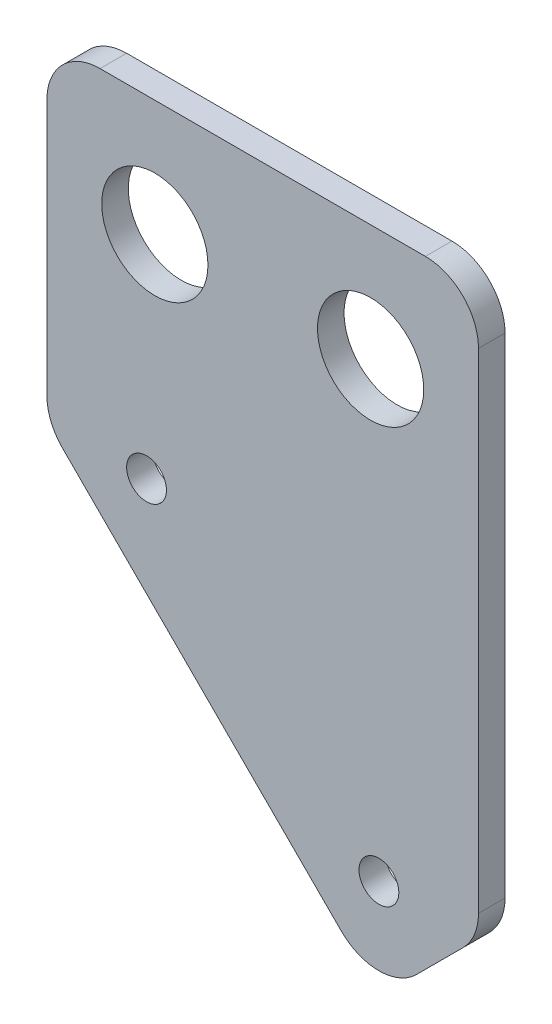
ISO-10303-21;
HEADER;
FILE_DESCRIPTION(('STEP AP214'),'2;1');
FILE_NAME('part.step','',(''),(''),'','','');
FILE_SCHEMA(('AUTOMOTIVE_DESIGN { 1 0 10303 214 1 1 1 1 }'));
ENDSEC;
DATA;
#1=APPLICATION_CONTEXT('core data for automotive mechanical design processes');
#2=APPLICATION_PROTOCOL_DEFINITION('international standard','automotive_design',2000,#1);
#3=PRODUCT_CONTEXT('',#1,'mechanical');
#4=PRODUCT('Part','Part','',(#3));
#5=PRODUCT_RELATED_PRODUCT_CATEGORY('part','',(#4));
#6=PRODUCT_DEFINITION_FORMATION('','',#4);
#7=PRODUCT_DEFINITION_CONTEXT('part definition',#1,'design');
#8=PRODUCT_DEFINITION('design','',#6,#7);
#9=PRODUCT_DEFINITION_SHAPE('','',#8);
#10=(LENGTH_UNIT() NAMED_UNIT(*) SI_UNIT(.MILLI.,.METRE.));
#11=(NAMED_UNIT(*) PLANE_ANGLE_UNIT() SI_UNIT($,.RADIAN.));
#12=(NAMED_UNIT(*) SI_UNIT($,.STERADIAN.) SOLID_ANGLE_UNIT());
#13=UNCERTAINTY_MEASURE_WITH_UNIT(LENGTH_MEASURE(1.E-05),#10,'distance_accuracy_value','');
#14=(GEOMETRIC_REPRESENTATION_CONTEXT(3) GLOBAL_UNCERTAINTY_ASSIGNED_CONTEXT((#13)) GLOBAL_UNIT_ASSIGNED_CONTEXT((#10,
#11,#12)) REPRESENTATION_CONTEXT('',''));
#15=CARTESIAN_POINT('',(0.,0.,0.));
#16=DIRECTION('',(0.,0.,1.));
#17=DIRECTION('',(1.,0.,0.));
#18=AXIS2_PLACEMENT_3D('',#15,#16,#17);
#19=CARTESIAN_POINT('',(-3.5,1.65685424949238,2.));
#20=DIRECTION('',(0.,0.,1.));
#21=DIRECTION('',(1.,0.,0.));
#22=AXIS2_PLACEMENT_3D('',#19,#20,#21);
#23=PLANE('',#22);
#24=CARTESIAN_POINT('',(0.624999999999999,16.25,2.));
#25=DIRECTION('',(0.,0.,1.));
#26=DIRECTION('',(1.,0.,0.));
#27=AXIS2_PLACEMENT_3D('',#24,#25,#26);
#28=CIRCLE('',#27,4.);
#29=CARTESIAN_POINT('',(4.625,16.25,2.));
#30=VERTEX_POINT('',#29);
#31=EDGE_CURVE('E218',#30,#30,#28,.T.);
#32=ORIENTED_EDGE('',*,*,#31,.F.);
#33=EDGE_LOOP('',(#32));
#34=FACE_BOUND('',#33,.T.);
#35=CARTESIAN_POINT('',(0.,0.,2.));
#36=DIRECTION('',(0.,0.,1.));
#37=DIRECTION('',(1.,0.,0.));
#38=AXIS2_PLACEMENT_3D('',#35,#36,#37);
#39=CIRCLE('',#38,1.5);
#40=CARTESIAN_POINT('',(1.5,0.,2.));
#41=VERTEX_POINT('',#40);
#42=EDGE_CURVE('E146',#41,#41,#39,.T.);
#43=ORIENTED_EDGE('',*,*,#42,.F.);
#44=EDGE_LOOP('',(#43));
#45=FACE_BOUND('',#44,.T.);
#46=CARTESIAN_POINT('',(-3.5,1.65685424949238,2.));
#47=DIRECTION('',(0.,0.,1.));
#48=DIRECTION('',(1.,0.,0.));
#49=AXIS2_PLACEMENT_3D('',#46,#47,#48);
#50=CIRCLE('',#49,4.);
#51=CARTESIAN_POINT('',(-7.5,1.6568542494924,2.));
#52=VERTEX_POINT('',#51);
#53=CARTESIAN_POINT('',(-6.32842712474618,-1.17157287525382,2.));
#54=VERTEX_POINT('',#53);
#55=EDGE_CURVE('E161',#52,#54,#50,.T.);
#56=ORIENTED_EDGE('',*,*,#55,.T.);
#57=DIRECTION('',(0.707106781186547,-0.707106781186547,0.));
#58=VECTOR('',#57,1.);
#59=CARTESIAN_POINT('',(14.6715728752538,-22.1715728752538,2.));
#60=LINE('',#59,#58);
#61=CARTESIAN_POINT('',(14.6715728752538,-22.1715728752538,2.));
#62=VERTEX_POINT('',#61);
#63=EDGE_CURVE('E99',#54,#62,#60,.T.);
#64=ORIENTED_EDGE('',*,*,#63,.T.);
#65=CARTESIAN_POINT('',(17.5,-19.3431457505076,2.));
#66=DIRECTION('',(0.,0.,1.));
#67=DIRECTION('',(-1.,0.,0.));
#68=AXIS2_PLACEMENT_3D('',#65,#66,#67);
#69=CIRCLE('',#68,4.);
#70=CARTESIAN_POINT('',(20.3284271247462,-22.1715728752538,2.));
#71=VERTEX_POINT('',#70);
#72=EDGE_CURVE('E182',#62,#71,#69,.T.);
#73=ORIENTED_EDGE('',*,*,#72,.T.);
#74=DIRECTION('',(0.707106781186547,0.707106781186547,0.));
#75=VECTOR('',#74,1.);
#76=CARTESIAN_POINT('',(23.8284271247462,-18.6715728752538,2.));
#77=LINE('',#76,#75);
#78=CARTESIAN_POINT('',(23.8284271247462,-18.6715728752538,2.));
#79=VERTEX_POINT('',#78);
#80=EDGE_CURVE('E201',#71,#79,#77,.T.);
#81=ORIENTED_EDGE('',*,*,#80,.T.);
#82=CARTESIAN_POINT('',(21.,-15.8431457505076,2.));
#83=DIRECTION('',(0.,0.,1.));
#84=DIRECTION('',(1.,0.,0.));
#85=AXIS2_PLACEMENT_3D('',#82,#83,#84);
#86=CIRCLE('',#85,4.);
#87=CARTESIAN_POINT('',(25.,-15.8431457505076,2.));
#88=VERTEX_POINT('',#87);
#89=EDGE_CURVE('E198',#79,#88,#86,.T.);
#90=ORIENTED_EDGE('',*,*,#89,.T.);
#91=DIRECTION('',(0.,1.,0.));
#92=VECTOR('',#91,1.);
#93=CARTESIAN_POINT('',(25.,21.,2.));
#94=LINE('',#93,#92);
#95=CARTESIAN_POINT('',(25.,21.,2.));
#96=VERTEX_POINT('',#95);
#97=EDGE_CURVE('E200',#88,#96,#94,.T.);
#98=ORIENTED_EDGE('',*,*,#97,.T.);
#99=CARTESIAN_POINT('',(21.,21.,2.));
#100=DIRECTION('',(0.,0.,1.));
#101=DIRECTION('',(-1.,0.,0.));
#102=AXIS2_PLACEMENT_3D('',#99,#100,#101);
#103=CIRCLE('',#102,4.);
#104=CARTESIAN_POINT('',(21.,25.,2.));
#105=VERTEX_POINT('',#104);
#106=EDGE_CURVE('E124',#96,#105,#103,.T.);
#107=ORIENTED_EDGE('',*,*,#106,.T.);
#108=DIRECTION('',(-1.,0.,0.));
#109=VECTOR('',#108,1.);
#110=CARTESIAN_POINT('',(-3.49999999999997,25.,2.));
#111=LINE('',#110,#109);
#112=CARTESIAN_POINT('',(-3.49999999999997,25.,2.));
#113=VERTEX_POINT('',#112);
#114=EDGE_CURVE('E118',#105,#113,#111,.T.);
#115=ORIENTED_EDGE('',*,*,#114,.T.);
#116=CARTESIAN_POINT('',(-3.5,21.,2.));
#117=DIRECTION('',(0.,0.,1.));
#118=DIRECTION('',(-1.,0.,0.));
#119=AXIS2_PLACEMENT_3D('',#116,#117,#118);
#120=CIRCLE('',#119,4.);
#121=CARTESIAN_POINT('',(-7.5,21.,2.));
#122=VERTEX_POINT('',#121);
#123=EDGE_CURVE('E122',#113,#122,#120,.T.);
#124=ORIENTED_EDGE('',*,*,#123,.T.);
#125=DIRECTION('',(0.,-1.,0.));
#126=VECTOR('',#125,1.);
#127=CARTESIAN_POINT('',(-7.5,1.6568542494924,2.));
#128=LINE('',#127,#126);
#129=EDGE_CURVE('E50',#122,#52,#128,.T.);
#130=ORIENTED_EDGE('',*,*,#129,.T.);
#131=EDGE_LOOP('',(#56,#64,#73,#81,#90,#98,#107,#115,#124,#130));
#132=FACE_BOUND('',#131,.T.);
#133=CARTESIAN_POINT('',(17.5,-17.5,2.));
#134=DIRECTION('',(0.,0.,1.));
#135=DIRECTION('',(1.,0.,0.));
#136=AXIS2_PLACEMENT_3D('',#133,#134,#135);
#137=CIRCLE('',#136,1.5);
#138=CARTESIAN_POINT('',(19.,-17.5,2.));
#139=VERTEX_POINT('',#138);
#140=EDGE_CURVE('E212',#139,#139,#137,.T.);
#141=ORIENTED_EDGE('',*,*,#140,.F.);
#142=EDGE_LOOP('',(#141));
#143=FACE_BOUND('',#142,.T.);
#144=CARTESIAN_POINT('',(16.875,16.25,2.));
#145=DIRECTION('',(0.,0.,1.));
#146=DIRECTION('',(1.,0.,0.));
#147=AXIS2_PLACEMENT_3D('',#144,#145,#146);
#148=CIRCLE('',#147,4.);
#149=CARTESIAN_POINT('',(20.875,16.25,2.));
#150=VERTEX_POINT('',#149);
#151=EDGE_CURVE('E224',#150,#150,#148,.T.);
#152=ORIENTED_EDGE('',*,*,#151,.F.);
#153=EDGE_LOOP('',(#152));
#154=FACE_BOUND('',#153,.T.);
#155=ADVANCED_FACE('F33',(#34,#45,#132,#143,#154),#23,.T.);
#156=CARTESIAN_POINT('',(-3.5,1.65685424949238,0.));
#157=DIRECTION('',(0.,0.,1.));
#158=DIRECTION('',(1.,0.,0.));
#159=AXIS2_PLACEMENT_3D('',#156,#157,#158);
#160=PLANE('',#159);
#161=CARTESIAN_POINT('',(-3.5,1.65685424949238,0.));
#162=DIRECTION('',(0.,0.,1.));
#163=DIRECTION('',(1.,0.,0.));
#164=AXIS2_PLACEMENT_3D('',#161,#162,#163);
#165=CIRCLE('',#164,4.);
#166=CARTESIAN_POINT('',(-7.5,1.6568542494924,0.));
#167=VERTEX_POINT('',#166);
#168=CARTESIAN_POINT('',(-6.32842712474618,-1.17157287525382,0.));
#169=VERTEX_POINT('',#168);
#170=EDGE_CURVE('E142',#167,#169,#165,.T.);
#171=ORIENTED_EDGE('',*,*,#170,.F.);
#172=DIRECTION('',(0.,-1.,0.));
#173=VECTOR('',#172,1.);
#174=CARTESIAN_POINT('',(-7.5,1.6568542494924,0.));
#175=LINE('',#174,#173);
#176=CARTESIAN_POINT('',(-7.5,21.,0.));
#177=VERTEX_POINT('',#176);
#178=EDGE_CURVE('E91',#177,#167,#175,.T.);
#179=ORIENTED_EDGE('',*,*,#178,.F.);
#180=CARTESIAN_POINT('',(-3.5,21.,0.));
#181=DIRECTION('',(0.,0.,1.));
#182=DIRECTION('',(-1.,0.,0.));
#183=AXIS2_PLACEMENT_3D('',#180,#181,#182);
#184=CIRCLE('',#183,4.);
#185=CARTESIAN_POINT('',(-3.49999999999997,25.,0.));
#186=VERTEX_POINT('',#185);
#187=EDGE_CURVE('E85',#186,#177,#184,.T.);
#188=ORIENTED_EDGE('',*,*,#187,.F.);
#189=DIRECTION('',(-1.,0.,0.));
#190=VECTOR('',#189,1.);
#191=CARTESIAN_POINT('',(-3.49999999999997,25.,0.));
#192=LINE('',#191,#190);
#193=CARTESIAN_POINT('',(21.,25.,0.));
#194=VERTEX_POINT('',#193);
#195=EDGE_CURVE('E132',#194,#186,#192,.T.);
#196=ORIENTED_EDGE('',*,*,#195,.F.);
#197=CARTESIAN_POINT('',(21.,21.,0.));
#198=DIRECTION('',(0.,0.,1.));
#199=DIRECTION('',(-1.,0.,0.));
#200=AXIS2_PLACEMENT_3D('',#197,#198,#199);
#201=CIRCLE('',#200,4.);
#202=CARTESIAN_POINT('',(25.,21.,0.));
#203=VERTEX_POINT('',#202);
#204=EDGE_CURVE('E156',#203,#194,#201,.T.);
#205=ORIENTED_EDGE('',*,*,#204,.F.);
#206=DIRECTION('',(0.,1.,0.));
#207=VECTOR('',#206,1.);
#208=CARTESIAN_POINT('',(25.,21.,0.));
#209=LINE('',#208,#207);
#210=CARTESIAN_POINT('',(25.,-15.8431457505076,0.));
#211=VERTEX_POINT('',#210);
#212=EDGE_CURVE('E154',#211,#203,#209,.T.);
#213=ORIENTED_EDGE('',*,*,#212,.F.);
#214=CARTESIAN_POINT('',(21.,-15.8431457505076,0.));
#215=DIRECTION('',(0.,0.,1.));
#216=DIRECTION('',(1.,0.,0.));
#217=AXIS2_PLACEMENT_3D('',#214,#215,#216);
#218=CIRCLE('',#217,4.);
#219=CARTESIAN_POINT('',(23.8284271247462,-18.6715728752538,0.));
#220=VERTEX_POINT('',#219);
#221=EDGE_CURVE('E152',#220,#211,#218,.T.);
#222=ORIENTED_EDGE('',*,*,#221,.F.);
#223=DIRECTION('',(0.707106781186547,0.707106781186547,0.));
#224=VECTOR('',#223,1.);
#225=CARTESIAN_POINT('',(23.8284271247462,-18.6715728752538,0.));
#226=LINE('',#225,#224);
#227=CARTESIAN_POINT('',(20.3284271247462,-22.1715728752538,0.));
#228=VERTEX_POINT('',#227);
#229=EDGE_CURVE('E150',#228,#220,#226,.T.);
#230=ORIENTED_EDGE('',*,*,#229,.F.);
#231=CARTESIAN_POINT('',(17.5,-19.3431457505076,0.));
#232=DIRECTION('',(0.,0.,1.));
#233=DIRECTION('',(-1.,0.,0.));
#234=AXIS2_PLACEMENT_3D('',#231,#232,#233);
#235=CIRCLE('',#234,4.);
#236=CARTESIAN_POINT('',(14.6715728752538,-22.1715728752538,0.));
#237=VERTEX_POINT('',#236);
#238=EDGE_CURVE('E148',#237,#228,#235,.T.);
#239=ORIENTED_EDGE('',*,*,#238,.F.);
#240=DIRECTION('',(0.707106781186547,-0.707106781186547,0.));
#241=VECTOR('',#240,1.);
#242=CARTESIAN_POINT('',(14.6715728752538,-22.1715728752538,0.));
#243=LINE('',#242,#241);
#244=EDGE_CURVE('E145',#169,#237,#243,.T.);
#245=ORIENTED_EDGE('',*,*,#244,.F.);
#246=EDGE_LOOP('',(#171,#179,#188,#196,#205,#213,#222,#230,#239,#245));
#247=FACE_BOUND('',#246,.T.);
#248=CARTESIAN_POINT('',(0.,0.,0.));
#249=DIRECTION('',(0.,0.,1.));
#250=DIRECTION('',(1.,0.,0.));
#251=AXIS2_PLACEMENT_3D('',#248,#249,#250);
#252=CIRCLE('',#251,1.5);
#253=CARTESIAN_POINT('',(1.5,0.,0.));
#254=VERTEX_POINT('',#253);
#255=EDGE_CURVE('E209',#254,#254,#252,.T.);
#256=ORIENTED_EDGE('',*,*,#255,.T.);
#257=EDGE_LOOP('',(#256));
#258=FACE_BOUND('',#257,.T.);
#259=CARTESIAN_POINT('',(17.5,-17.5,0.));
#260=DIRECTION('',(0.,0.,1.));
#261=DIRECTION('',(1.,0.,0.));
#262=AXIS2_PLACEMENT_3D('',#259,#260,#261);
#263=CIRCLE('',#262,1.5);
#264=CARTESIAN_POINT('',(19.,-17.5,0.));
#265=VERTEX_POINT('',#264);
#266=EDGE_CURVE('E215',#265,#265,#263,.T.);
#267=ORIENTED_EDGE('',*,*,#266,.T.);
#268=EDGE_LOOP('',(#267));
#269=FACE_BOUND('',#268,.T.);
#270=CARTESIAN_POINT('',(0.624999999999999,16.25,0.));
#271=DIRECTION('',(0.,0.,1.));
#272=DIRECTION('',(1.,0.,0.));
#273=AXIS2_PLACEMENT_3D('',#270,#271,#272);
#274=CIRCLE('',#273,4.);
#275=CARTESIAN_POINT('',(4.625,16.25,0.));
#276=VERTEX_POINT('',#275);
#277=EDGE_CURVE('E221',#276,#276,#274,.T.);
#278=ORIENTED_EDGE('',*,*,#277,.T.);
#279=EDGE_LOOP('',(#278));
#280=FACE_BOUND('',#279,.T.);
#281=CARTESIAN_POINT('',(16.875,16.25,0.));
#282=DIRECTION('',(0.,0.,1.));
#283=DIRECTION('',(1.,0.,0.));
#284=AXIS2_PLACEMENT_3D('',#281,#282,#283);
#285=CIRCLE('',#284,4.);
#286=CARTESIAN_POINT('',(20.875,16.25,0.));
#287=VERTEX_POINT('',#286);
#288=EDGE_CURVE('E227',#287,#287,#285,.T.);
#289=ORIENTED_EDGE('',*,*,#288,.T.);
#290=EDGE_LOOP('',(#289));
#291=FACE_BOUND('',#290,.T.);
#292=ADVANCED_FACE('F186',(#247,#258,#269,#280,#291),#160,.F.);
#293=CARTESIAN_POINT('',(-3.5,1.65685424949238,2.));
#294=DIRECTION('',(0.,0.,-1.));
#295=DIRECTION('',(-1.,0.,0.));
#296=AXIS2_PLACEMENT_3D('',#293,#294,#295);
#297=CYLINDRICAL_SURFACE('',#296,4.);
#298=ORIENTED_EDGE('',*,*,#170,.T.);
#299=DIRECTION('',(0.,0.,-1.));
#300=VECTOR('',#299,1.);
#301=CARTESIAN_POINT('',(-6.32842712474618,-1.17157287525382,2.));
#302=LINE('',#301,#300);
#303=EDGE_CURVE('E11',#54,#169,#302,.T.);
#304=ORIENTED_EDGE('',*,*,#303,.F.);
#305=ORIENTED_EDGE('',*,*,#55,.F.);
#306=DIRECTION('',(0.,0.,-1.));
#307=VECTOR('',#306,1.);
#308=CARTESIAN_POINT('',(-7.5,1.6568542494924,2.));
#309=LINE('',#308,#307);
#310=EDGE_CURVE('E138',#52,#167,#309,.T.);
#311=ORIENTED_EDGE('',*,*,#310,.T.);
#312=EDGE_LOOP('',(#298,#304,#305,#311));
#313=FACE_BOUND('',#312,.T.);
#314=ADVANCED_FACE('F35',(#313),#297,.T.);
#315=CARTESIAN_POINT('',(14.6715728752538,-22.1715728752538,2.));
#316=DIRECTION('',(0.707106781186547,0.707106781186547,0.));
#317=DIRECTION('',(-0.707106781186548,0.707106781186548,0.));
#318=AXIS2_PLACEMENT_3D('',#315,#316,#317);
#319=PLANE('',#318);
#320=ORIENTED_EDGE('',*,*,#244,.T.);
#321=DIRECTION('',(0.,0.,-1.));
#322=VECTOR('',#321,1.);
#323=CARTESIAN_POINT('',(14.6715728752538,-22.1715728752538,2.));
#324=LINE('',#323,#322);
#325=EDGE_CURVE('E42',#62,#237,#324,.T.);
#326=ORIENTED_EDGE('',*,*,#325,.F.);
#327=ORIENTED_EDGE('',*,*,#63,.F.);
#328=ORIENTED_EDGE('',*,*,#303,.T.);
#329=EDGE_LOOP('',(#320,#326,#327,#328));
#330=FACE_BOUND('',#329,.T.);
#331=ADVANCED_FACE('F269',(#330),#319,.F.);
#332=CARTESIAN_POINT('',(17.5,-19.3431457505076,2.));
#333=DIRECTION('',(0.,0.,-1.));
#334=DIRECTION('',(-1.,0.,0.));
#335=AXIS2_PLACEMENT_3D('',#332,#333,#334);
#336=CYLINDRICAL_SURFACE('',#335,4.);
#337=ORIENTED_EDGE('',*,*,#238,.T.);
#338=DIRECTION('',(0.,0.,-1.));
#339=VECTOR('',#338,1.);
#340=CARTESIAN_POINT('',(20.3284271247462,-22.1715728752538,2.));
#341=LINE('',#340,#339);
#342=EDGE_CURVE('E174',#71,#228,#341,.T.);
#343=ORIENTED_EDGE('',*,*,#342,.F.);
#344=ORIENTED_EDGE('',*,*,#72,.F.);
#345=ORIENTED_EDGE('',*,*,#325,.T.);
#346=EDGE_LOOP('',(#337,#343,#344,#345));
#347=FACE_BOUND('',#346,.T.);
#348=ADVANCED_FACE('F180',(#347),#336,.T.);
#349=CARTESIAN_POINT('',(23.8284271247462,-18.6715728752538,2.));
#350=DIRECTION('',(-0.707106781186547,0.707106781186547,0.));
#351=DIRECTION('',(-0.707106781186548,-0.707106781186548,0.));
#352=AXIS2_PLACEMENT_3D('',#349,#350,#351);
#353=PLANE('',#352);
#354=ORIENTED_EDGE('',*,*,#229,.T.);
#355=DIRECTION('',(0.,0.,-1.));
#356=VECTOR('',#355,1.);
#357=CARTESIAN_POINT('',(23.8284271247462,-18.6715728752538,2.));
#358=LINE('',#357,#356);
#359=EDGE_CURVE('E171',#79,#220,#358,.T.);
#360=ORIENTED_EDGE('',*,*,#359,.F.);
#361=ORIENTED_EDGE('',*,*,#80,.F.);
#362=ORIENTED_EDGE('',*,*,#342,.T.);
#363=EDGE_LOOP('',(#354,#360,#361,#362));
#364=FACE_BOUND('',#363,.T.);
#365=ADVANCED_FACE('F192',(#364),#353,.F.);
#366=CARTESIAN_POINT('',(21.,-15.8431457505076,2.));
#367=DIRECTION('',(0.,0.,-1.));
#368=DIRECTION('',(-1.,0.,0.));
#369=AXIS2_PLACEMENT_3D('',#366,#367,#368);
#370=CYLINDRICAL_SURFACE('',#369,4.);
#371=ORIENTED_EDGE('',*,*,#221,.T.);
#372=DIRECTION('',(0.,0.,-1.));
#373=VECTOR('',#372,1.);
#374=CARTESIAN_POINT('',(25.,-15.8431457505076,2.));
#375=LINE('',#374,#373);
#376=EDGE_CURVE('E168',#88,#211,#375,.T.);
#377=ORIENTED_EDGE('',*,*,#376,.F.);
#378=ORIENTED_EDGE('',*,*,#89,.F.);
#379=ORIENTED_EDGE('',*,*,#359,.T.);
#380=EDGE_LOOP('',(#371,#377,#378,#379));
#381=FACE_BOUND('',#380,.T.);
#382=ADVANCED_FACE('F196',(#381),#370,.T.);
#383=CARTESIAN_POINT('',(25.,21.,2.));
#384=DIRECTION('',(-1.,0.,0.));
#385=DIRECTION('',(0.,0.,1.));
#386=AXIS2_PLACEMENT_3D('',#383,#384,#385);
#387=PLANE('',#386);
#388=ORIENTED_EDGE('',*,*,#212,.T.);
#389=DIRECTION('',(0.,0.,-1.));
#390=VECTOR('',#389,1.);
#391=CARTESIAN_POINT('',(25.,21.,2.));
#392=LINE('',#391,#390);
#393=EDGE_CURVE('E165',#96,#203,#392,.T.);
#394=ORIENTED_EDGE('',*,*,#393,.F.);
#395=ORIENTED_EDGE('',*,*,#97,.F.);
#396=ORIENTED_EDGE('',*,*,#376,.T.);
#397=EDGE_LOOP('',(#388,#394,#395,#396));
#398=FACE_BOUND('',#397,.T.);
#399=ADVANCED_FACE('F259',(#398),#387,.F.);
#400=CARTESIAN_POINT('',(21.,21.,2.));
#401=DIRECTION('',(0.,0.,-1.));
#402=DIRECTION('',(-1.,0.,0.));
#403=AXIS2_PLACEMENT_3D('',#400,#401,#402);
#404=CYLINDRICAL_SURFACE('',#403,4.);
#405=ORIENTED_EDGE('',*,*,#204,.T.);
#406=DIRECTION('',(0.,0.,-1.));
#407=VECTOR('',#406,1.);
#408=CARTESIAN_POINT('',(21.,25.,2.));
#409=LINE('',#408,#407);
#410=EDGE_CURVE('E133',#105,#194,#409,.T.);
#411=ORIENTED_EDGE('',*,*,#410,.F.);
#412=ORIENTED_EDGE('',*,*,#106,.F.);
#413=ORIENTED_EDGE('',*,*,#393,.T.);
#414=EDGE_LOOP('',(#405,#411,#412,#413));
#415=FACE_BOUND('',#414,.T.);
#416=ADVANCED_FACE('F256',(#415),#404,.T.);
#417=CARTESIAN_POINT('',(-3.49999999999997,25.,2.));
#418=DIRECTION('',(0.,-1.,0.));
#419=DIRECTION('',(0.,0.,-1.));
#420=AXIS2_PLACEMENT_3D('',#417,#418,#419);
#421=PLANE('',#420);
#422=ORIENTED_EDGE('',*,*,#195,.T.);
#423=DIRECTION('',(0.,0.,-1.));
#424=VECTOR('',#423,1.);
#425=CARTESIAN_POINT('',(-3.49999999999997,25.,2.));
#426=LINE('',#425,#424);
#427=EDGE_CURVE('E129',#113,#186,#426,.T.);
#428=ORIENTED_EDGE('',*,*,#427,.F.);
#429=ORIENTED_EDGE('',*,*,#114,.F.);
#430=ORIENTED_EDGE('',*,*,#410,.T.);
#431=EDGE_LOOP('',(#422,#428,#429,#430));
#432=FACE_BOUND('',#431,.T.);
#433=ADVANCED_FACE('F130',(#432),#421,.F.);
#434=CARTESIAN_POINT('',(-3.5,21.,2.));
#435=DIRECTION('',(0.,0.,-1.));
#436=DIRECTION('',(-1.,0.,0.));
#437=AXIS2_PLACEMENT_3D('',#434,#435,#436);
#438=CYLINDRICAL_SURFACE('',#437,4.);
#439=ORIENTED_EDGE('',*,*,#187,.T.);
#440=DIRECTION('',(0.,0.,-1.));
#441=VECTOR('',#440,1.);
#442=CARTESIAN_POINT('',(-7.5,21.,2.));
#443=LINE('',#442,#441);
#444=EDGE_CURVE('E134',#122,#177,#443,.T.);
#445=ORIENTED_EDGE('',*,*,#444,.F.);
#446=ORIENTED_EDGE('',*,*,#123,.F.);
#447=ORIENTED_EDGE('',*,*,#427,.T.);
#448=EDGE_LOOP('',(#439,#445,#446,#447));
#449=FACE_BOUND('',#448,.T.);
#450=ADVANCED_FACE('F136',(#449),#438,.T.);
#451=CARTESIAN_POINT('',(-7.5,1.6568542494924,2.));
#452=DIRECTION('',(1.,0.,0.));
#453=DIRECTION('',(0.,0.,-1.));
#454=AXIS2_PLACEMENT_3D('',#451,#452,#453);
#455=PLANE('',#454);
#456=ORIENTED_EDGE('',*,*,#178,.T.);
#457=ORIENTED_EDGE('',*,*,#310,.F.);
#458=ORIENTED_EDGE('',*,*,#129,.F.);
#459=ORIENTED_EDGE('',*,*,#444,.T.);
#460=EDGE_LOOP('',(#456,#457,#458,#459));
#461=FACE_BOUND('',#460,.T.);
#462=ADVANCED_FACE('F249',(#461),#455,.F.);
#463=CARTESIAN_POINT('',(0.,0.,2.));
#464=DIRECTION('',(0.,0.,-1.));
#465=DIRECTION('',(-1.,0.,0.));
#466=AXIS2_PLACEMENT_3D('',#463,#464,#465);
#467=CYLINDRICAL_SURFACE('',#466,1.5);
#468=ORIENTED_EDGE('',*,*,#42,.T.);
#469=EDGE_LOOP('',(#468));
#470=FACE_BOUND('',#469,.T.);
#471=ORIENTED_EDGE('',*,*,#255,.F.);
#472=EDGE_LOOP('',(#471));
#473=FACE_BOUND('',#472,.T.);
#474=ADVANCED_FACE('F246',(#470,#473),#467,.F.);
#475=CARTESIAN_POINT('',(17.5,-17.5,2.));
#476=DIRECTION('',(0.,0.,-1.));
#477=DIRECTION('',(-1.,0.,0.));
#478=AXIS2_PLACEMENT_3D('',#475,#476,#477);
#479=CYLINDRICAL_SURFACE('',#478,1.5);
#480=ORIENTED_EDGE('',*,*,#140,.T.);
#481=EDGE_LOOP('',(#480));
#482=FACE_BOUND('',#481,.T.);
#483=ORIENTED_EDGE('',*,*,#266,.F.);
#484=EDGE_LOOP('',(#483));
#485=FACE_BOUND('',#484,.T.);
#486=ADVANCED_FACE('F345',(#482,#485),#479,.F.);
#487=CARTESIAN_POINT('',(0.624999999999999,16.25,2.));
#488=DIRECTION('',(0.,0.,-1.));
#489=DIRECTION('',(-1.,0.,0.));
#490=AXIS2_PLACEMENT_3D('',#487,#488,#489);
#491=CYLINDRICAL_SURFACE('',#490,4.);
#492=ORIENTED_EDGE('',*,*,#31,.T.);
#493=EDGE_LOOP('',(#492));
#494=FACE_BOUND('',#493,.T.);
#495=ORIENTED_EDGE('',*,*,#277,.F.);
#496=EDGE_LOOP('',(#495));
#497=FACE_BOUND('',#496,.T.);
#498=ADVANCED_FACE('F353',(#494,#497),#491,.F.);
#499=CARTESIAN_POINT('',(16.875,16.25,2.));
#500=DIRECTION('',(0.,0.,-1.));
#501=DIRECTION('',(-1.,0.,0.));
#502=AXIS2_PLACEMENT_3D('',#499,#500,#501);
#503=CYLINDRICAL_SURFACE('',#502,4.);
#504=ORIENTED_EDGE('',*,*,#151,.T.);
#505=EDGE_LOOP('',(#504));
#506=FACE_BOUND('',#505,.T.);
#507=ORIENTED_EDGE('',*,*,#288,.F.);
#508=EDGE_LOOP('',(#507));
#509=FACE_BOUND('',#508,.T.);
#510=ADVANCED_FACE('F233',(#506,#509),#503,.F.);
#511=CLOSED_SHELL('',(#155,#292,#314,#331,#348,#365,#382,#399,#416,#433,#450,#462,#474,#486,
#498,#510));
#512=MANIFOLD_SOLID_BREP('B2',#511);
#513=ADVANCED_BREP_SHAPE_REPRESENTATION('',(#18,#512),#14);
#514=SHAPE_DEFINITION_REPRESENTATION(#9,#513);
ENDSEC;
END-ISO-10303-21;
